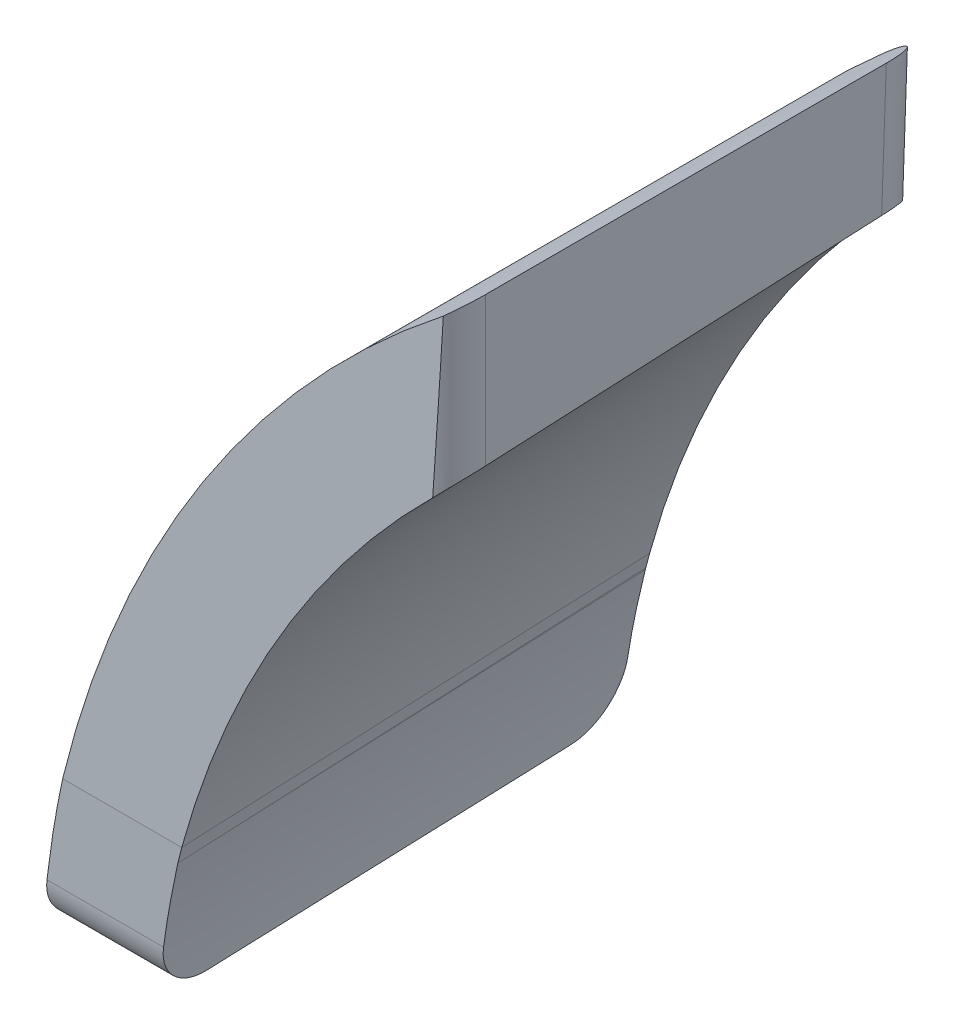
ISO-10303-21;
HEADER;
FILE_DESCRIPTION(('STEP AP214'),'2;1');
FILE_NAME('part.step','',(''),(''),'','','');
FILE_SCHEMA(('AUTOMOTIVE_DESIGN { 1 0 10303 214 1 1 1 1 }'));
ENDSEC;
DATA;
#1=APPLICATION_CONTEXT('core data for automotive mechanical design processes');
#2=APPLICATION_PROTOCOL_DEFINITION('international standard','automotive_design',2000,#1);
#3=PRODUCT_CONTEXT('',#1,'mechanical');
#4=PRODUCT('Part','Part','',(#3));
#5=PRODUCT_RELATED_PRODUCT_CATEGORY('part','',(#4));
#6=PRODUCT_DEFINITION_FORMATION('','',#4);
#7=PRODUCT_DEFINITION_CONTEXT('part definition',#1,'design');
#8=PRODUCT_DEFINITION('design','',#6,#7);
#9=PRODUCT_DEFINITION_SHAPE('','',#8);
#10=(LENGTH_UNIT() NAMED_UNIT(*) SI_UNIT(.MILLI.,.METRE.));
#11=(NAMED_UNIT(*) PLANE_ANGLE_UNIT() SI_UNIT($,.RADIAN.));
#12=(NAMED_UNIT(*) SI_UNIT($,.STERADIAN.) SOLID_ANGLE_UNIT());
#13=UNCERTAINTY_MEASURE_WITH_UNIT(LENGTH_MEASURE(1.E-05),#10,'distance_accuracy_value','');
#14=(GEOMETRIC_REPRESENTATION_CONTEXT(3) GLOBAL_UNCERTAINTY_ASSIGNED_CONTEXT((#13)) GLOBAL_UNIT_ASSIGNED_CONTEXT((#10,
#11,#12)) REPRESENTATION_CONTEXT('',''));
#15=CARTESIAN_POINT('',(0.,0.,0.));
#16=DIRECTION('',(0.,0.,1.));
#17=DIRECTION('',(1.,0.,0.));
#18=AXIS2_PLACEMENT_3D('',#15,#16,#17);
#19=CARTESIAN_POINT('',(-0.10127246753997,1.5,2.));
#20=DIRECTION('',(1.,0.,0.));
#21=DIRECTION('',(0.,0.,1.));
#22=AXIS2_PLACEMENT_3D('',#19,#20,#21);
#23=CYLINDRICAL_SURFACE('',#22,0.5);
#24=DIRECTION('',(-1.,0.,0.));
#25=VECTOR('',#24,1.);
#26=CARTESIAN_POINT('',(-0.10127246753997,1.,2.));
#27=LINE('',#26,#25);
#28=CARTESIAN_POINT('',(-9.38434590084824,1.,2.));
#29=VERTEX_POINT('',#28);
#30=CARTESIAN_POINT('',(-10.3526138431845,1.,2.));
#31=VERTEX_POINT('',#30);
#32=EDGE_CURVE('E142',#29,#31,#27,.T.);
#33=ORIENTED_EDGE('',*,*,#32,.T.);
#34=CARTESIAN_POINT('',(-10.3526138431845,1.,2.));
#35=CARTESIAN_POINT('',(-10.3526129499968,0.999975608279934,1.97198227180452));
#36=CARTESIAN_POINT('',(-10.3523842095059,1.00235350446522,1.94397209767279));
#37=CARTESIAN_POINT('',(-10.3514644289788,1.01173349210152,1.88876893584366));
#38=CARTESIAN_POINT('',(-10.3507737937514,1.01873153434342,1.86157525435133));
#39=CARTESIAN_POINT('',(-10.3489232195765,1.03717621557399,1.8087433462739));
#40=CARTESIAN_POINT('',(-10.3477630667695,1.04862488167309,1.78310583463273));
#41=CARTESIAN_POINT('',(-10.3449638139676,1.07562648040276,1.73412680593719));
#42=CARTESIAN_POINT('',(-10.3433247880487,1.09117877821559,1.71078493452118));
#43=CARTESIAN_POINT('',(-10.3395592975666,1.12596088273112,1.66701759573912));
#44=CARTESIAN_POINT('',(-10.3374321762692,1.14519563836545,1.64659611841736));
#45=CARTESIAN_POINT('',(-10.3326949167815,1.18677361667692,1.6092702082525));
#46=CARTESIAN_POINT('',(-10.3300846915961,1.20911739903261,1.59236641002279));
#47=CARTESIAN_POINT('',(-10.3243881912718,1.25637306430513,1.56247113555211));
#48=CARTESIAN_POINT('',(-10.3212997778566,1.28129630691665,1.54949804678478));
#49=CARTESIAN_POINT('',(-10.3146964692529,1.33290863576065,1.52791744521672));
#50=CARTESIAN_POINT('',(-10.3111817558962,1.35959696692761,1.51930807919403));
#51=CARTESIAN_POINT('',(-10.304964337901,1.40535557787735,1.50866822222638));
#52=CARTESIAN_POINT('',(-10.3023565222196,1.42416476860025,1.50541808656274));
#53=CARTESIAN_POINT('',(-10.2970055783103,1.46198309803636,1.50108420788972));
#54=CARTESIAN_POINT('',(-10.2942626580344,1.48099189609032,1.49999723593008));
#55=CARTESIAN_POINT('',(-10.2914638298254,1.50000000000133,1.5));
#56=B_SPLINE_CURVE_WITH_KNOTS('',3,(#34,#35,#36,#37,#38,#39,#40,#41,#42,#43,#44,#45,#46,#47,#48,
#49,#50,#51,#52,#53,#54,#55),.UNSPECIFIED.,.F.,.F.,(4,2,2,2,2,2,2,2,2,2,4),(0.,
0.0839406182501633,0.167807766375455,0.251713158023279,0.335605577397045,0.419611543188889,
0.503632651118584,0.588040939969054,0.672413351508142,0.73009306778627,0.787686620890018),.UNSPECIFIED.);
#57=CARTESIAN_POINT('',(-10.2914638298513,1.49999999982513,1.5));
#58=VERTEX_POINT('',#57);
#59=EDGE_CURVE('E135',#31,#58,#56,.T.);
#60=ORIENTED_EDGE('',*,*,#59,.T.);
#61=DIRECTION('',(1.,-1.62395537629E-09,0.));
#62=VECTOR('',#61,1.);
#63=CARTESIAN_POINT('',(-9.82646688726997,1.49999999907,1.5));
#64=LINE('',#63,#62);
#65=CARTESIAN_POINT('',(-9.33474938176077,1.50000000000132,1.5));
#66=VERTEX_POINT('',#65);
#67=EDGE_CURVE('E139',#58,#66,#64,.T.);
#68=ORIENTED_EDGE('',*,*,#67,.T.);
#69=CARTESIAN_POINT('',(-9.38434590084824,1.,2.));
#70=CARTESIAN_POINT('',(-9.38532570922651,0.999975509679983,1.97207405433316));
#71=CARTESIAN_POINT('',(-9.38605679583867,1.00233816426967,1.94414526561396));
#72=CARTESIAN_POINT('',(-9.3869858098614,1.01166697956543,1.88907897468974));
#73=CARTESIAN_POINT('',(-9.3871841371224,1.01862968291633,1.8619408941773));
#74=CARTESIAN_POINT('',(-9.3870134473969,1.03699326952491,1.80919440088129));
#75=CARTESIAN_POINT('',(-9.38664412195896,1.04839656319873,1.78358682760184));
#76=CARTESIAN_POINT('',(-9.38530106497489,1.07530253968393,1.73464897912187));
#77=CARTESIAN_POINT('',(-9.38432745257583,1.09080441403364,1.71131825604464));
#78=CARTESIAN_POINT('',(-9.38174753359139,1.12544259462695,1.66760908394929));
#79=CARTESIAN_POINT('',(-9.38014183616578,1.14457539247061,1.64722781823565));
#80=CARTESIAN_POINT('',(-9.37628197408023,1.18592797165769,1.60995709403816));
#81=CARTESIAN_POINT('',(-9.37402779364227,1.20814782810444,1.59306772053146));
#82=CARTESIAN_POINT('',(-9.36886960016253,1.25509450040792,1.56319582171056));
#83=CARTESIAN_POINT('',(-9.36596372776343,1.27982837642318,1.55022472930718));
#84=CARTESIAN_POINT('',(-9.35953851047382,1.33103709861525,1.5285943319381));
#85=CARTESIAN_POINT('',(-9.35601937265176,1.35751135528121,1.51993357538564));
#86=CARTESIAN_POINT('',(-9.34956102296081,1.40342622774852,1.50902768807008));
#87=CARTESIAN_POINT('',(-9.34675942575335,1.42262382895172,1.50564155189572));
#88=CARTESIAN_POINT('',(-9.34092247875129,1.46121781023742,1.50112774278194));
#89=CARTESIAN_POINT('',(-9.33788748720191,1.48061384756674,1.4999966775794));
#90=CARTESIAN_POINT('',(-9.33474938176077,1.50000000000133,1.5));
#91=B_SPLINE_CURVE_WITH_KNOTS('',3,(#69,#70,#71,#72,#73,#74,#75,#76,#77,#78,#79,#80,#81,#82,#83,
#84,#85,#86,#87,#88,#89,#90),.UNSPECIFIED.,.F.,.F.,(4,2,2,2,2,2,2,2,2,2,4),(0.,
0.0837201085768994,0.167377365348832,0.251080095921102,0.334766328092121,0.418372105943264,
0.501979918148702,0.585829379017167,0.669650582860887,0.728608379806995,0.787477420470714),.UNSPECIFIED.);
#92=EDGE_CURVE('E291',#29,#66,#91,.T.);
#93=ORIENTED_EDGE('',*,*,#92,.F.);
#94=EDGE_LOOP('',(#33,#60,#68,#93));
#95=FACE_BOUND('',#94,.T.);
#96=ADVANCED_FACE('F49',(#95),#23,.T.);
#97=CARTESIAN_POINT('',(-7.10096788104997,1.01744974835,2.));
#98=DIRECTION('',(0.0348994967025033,0.999390827019096,0.));
#99=DIRECTION('',(0.999390827019096,-0.0348994967025033,0.));
#100=AXIS2_PLACEMENT_3D('',#97,#98,#99);
#101=CYLINDRICAL_SURFACE('',#100,0.5);
#102=DIRECTION('',(0.03489949686881,0.999390827013288,0.));
#103=VECTOR('',#102,1.);
#104=CARTESIAN_POINT('',(-6.88850948867997,7.10146208853,1.5));
#105=LINE('',#104,#103);
#106=CARTESIAN_POINT('',(-6.91255897651646,6.41277486680576,1.5));
#107=VERTEX_POINT('',#106);
#108=CARTESIAN_POINT('',(-6.86524040910255,7.76780134178997,1.5));
#109=VERTEX_POINT('',#108);
#110=EDGE_CURVE('E164',#107,#109,#105,.T.);
#111=ORIENTED_EDGE('',*,*,#110,.T.);
#112=CARTESIAN_POINT('',(-6.86524040935667,7.76780134156869,1.5));
#113=CARTESIAN_POINT('',(-6.83355931530696,7.79539986986837,1.50002210660041));
#114=CARTESIAN_POINT('',(-6.80163414605223,7.82284723868128,1.5028330822727));
#115=CARTESIAN_POINT('',(-6.73785054495648,7.87702656022441,1.51445595446335));
#116=CARTESIAN_POINT('',(-6.70599457128704,7.9037512723461,1.52331443746681));
#117=CARTESIAN_POINT('',(-6.64682817149106,7.95279974820115,1.54615300714934));
#118=CARTESIAN_POINT('',(-6.61940037183814,7.97528593025986,1.55947073918397));
#119=CARTESIAN_POINT('',(-6.56635031237351,8.0183493202108,1.59154191719154));
#120=CARTESIAN_POINT('',(-6.54072318153055,8.03893172992001,1.61027993680259));
#121=CARTESIAN_POINT('',(-6.49775602987373,8.07313939478497,1.6486469390088));
#122=CARTESIAN_POINT('',(-6.47983929559043,8.08729474246429,1.66715459130067));
#123=CARTESIAN_POINT('',(-6.44649221641731,8.11348471863716,1.70762109641471));
#124=CARTESIAN_POINT('',(-6.43105979839128,8.12552111616601,1.7295770411231));
#125=CARTESIAN_POINT('',(-6.40589933924355,8.14505311674669,1.77266319935095));
#126=CARTESIAN_POINT('',(-6.3956471784414,8.15297317035518,1.79329368027229));
#127=CARTESIAN_POINT('',(-6.37797973968106,8.16658251626105,1.83640437142863));
#128=CARTESIAN_POINT('',(-6.37055945220272,8.17227574820406,1.85888122903217));
#129=CARTESIAN_POINT('',(-6.36003815351626,8.18033557215462,1.9010322766524));
#130=CARTESIAN_POINT('',(-6.35640419059473,8.18311332119276,1.92049557705234));
#131=CARTESIAN_POINT('',(-6.35150547327359,8.18685469788341,1.95996353985413));
#132=CARTESIAN_POINT('',(-6.3502499536713,8.18781125445195,1.9799700077065));
#133=CARTESIAN_POINT('',(-6.35026901757261,8.18779836816226,2.00000000000012));
#134=B_SPLINE_CURVE_WITH_KNOTS('',3,(#112,#113,#114,#115,#116,#117,#118,#119,#120,#121,#122,
#123,#124,#125,#126,#127,#128,#129,#130,#131,#132,#133),.UNSPECIFIED.,.F.,.F.,(4,2,2,2,2,2,2,2,
2,2,4),(0.,0.126093565037996,0.253169608356326,0.366415048037137,0.479341305304981,
0.567197296387475,0.654979588186308,0.72776531626551,0.800421684537745,0.860178718104615,
0.920167298911572),.UNSPECIFIED.);
#135=CARTESIAN_POINT('',(-6.35026901757346,8.18779836816262,2.));
#136=VERTEX_POINT('',#135);
#137=EDGE_CURVE('E152',#109,#136,#134,.T.);
#138=ORIENTED_EDGE('',*,*,#137,.T.);
#139=DIRECTION('',(-0.0348994967025033,-0.999390827019096,0.));
#140=VECTOR('',#139,1.);
#141=CARTESIAN_POINT('',(-6.37235653600997,7.55529459586,2.));
#142=LINE('',#141,#140);
#143=CARTESIAN_POINT('',(-6.3953267579391,6.89751350266002,2.00000000000012));
#144=VERTEX_POINT('',#143);
#145=EDGE_CURVE('E54',#136,#144,#142,.T.);
#146=ORIENTED_EDGE('',*,*,#145,.T.);
#147=CARTESIAN_POINT('',(-6.92385989719551,6.40074461378488,1.50011826192768));
#148=CARTESIAN_POINT('',(-6.90376092104102,6.42219094466016,1.49970476694414));
#149=CARTESIAN_POINT('',(-6.88351177886103,6.44353448769911,1.50039713014202));
#150=CARTESIAN_POINT('',(-6.84280745559294,6.48591945548131,1.50413631655415));
#151=CARTESIAN_POINT('',(-6.82235187571151,6.50695995053153,1.50718925613275));
#152=CARTESIAN_POINT('',(-6.78118787481859,6.5487802600666,1.51584792481502));
#153=CARTESIAN_POINT('',(-6.76047938443344,6.5695538553639,1.52148404547542));
#154=CARTESIAN_POINT('',(-6.71929498680125,6.61034641190091,1.53550671692901));
#155=CARTESIAN_POINT('',(-6.6988188293532,6.63036625234015,1.54388994515531));
#156=CARTESIAN_POINT('',(-6.65458037932288,6.67306017463445,1.56548341113036));
#157=CARTESIAN_POINT('',(-6.63091551378606,6.69553505675079,1.57930154703416));
#158=CARTESIAN_POINT('',(-6.5850144464817,6.73843028940704,1.61153489785195));
#159=CARTESIAN_POINT('',(-6.56277324945121,6.75885798401953,1.62993278994866));
#160=CARTESIAN_POINT('',(-6.52519570994582,6.79276887113519,1.66721131604768));
#161=CARTESIAN_POINT('',(-6.5094052342593,6.80679925876979,1.68513046032029));
#162=CARTESIAN_POINT('',(-6.47994298525797,6.83255270926025,1.72412590062754));
#163=CARTESIAN_POINT('',(-6.46626924745119,6.84427791426163,1.74519923316858));
#164=CARTESIAN_POINT('',(-6.44425924646983,6.86273860000031,1.78590888999709));
#165=CARTESIAN_POINT('',(-6.43540211924859,6.87000131795268,1.80502261200916));
#166=CARTESIAN_POINT('',(-6.42007763576422,6.88220996402258,1.84486445351273));
#167=CARTESIAN_POINT('',(-6.41360615764195,6.88715989211167,1.86558971287178));
#168=CARTESIAN_POINT('',(-6.40391409826051,6.89410583033422,1.90626770554647));
#169=CARTESIAN_POINT('',(-6.40045555276308,6.89632542709243,1.92612517473211));
#170=CARTESIAN_POINT('',(-6.39600709112188,6.89848338254314,1.96634607563305));
#171=CARTESIAN_POINT('',(-6.3950310805224,6.89840892174951,1.98671171492532));
#172=CARTESIAN_POINT('',(-6.39538940145649,6.89712523722026,2.00700376194722));
#173=B_SPLINE_CURVE_WITH_KNOTS('',3,(#147,#148,#149,#150,#151,#152,#153,#154,#155,#156,#157,
#158,#159,#160,#161,#162,#163,#164,#165,#166,#167,#168,#169,#170,#171,#172),.UNSPECIFIED.,.F.,
.F.,(4,2,2,2,2,2,2,2,2,2,2,2,4),(0.,0.0881824524501346,0.176594158597143,0.266073855463907,
0.35544572557985,0.461446024873163,0.567051316021728,0.649860331259337,0.732592026703035,
0.799172688949339,0.865637769722107,0.926190782810254,0.987082234912873),.UNSPECIFIED.);
#174=EDGE_CURVE('E350',#107,#144,#173,.T.);
#175=ORIENTED_EDGE('',*,*,#174,.F.);
#176=EDGE_LOOP('',(#111,#138,#146,#175));
#177=FACE_BOUND('',#176,.T.);
#178=ADVANCED_FACE('F369',(#177),#101,.T.);
#179=CARTESIAN_POINT('',(-0.10127246753997,0.,1.5));
#180=DIRECTION('',(0.,0.,1.));
#181=DIRECTION('',(1.,0.,0.));
#182=AXIS2_PLACEMENT_3D('',#179,#180,#181);
#183=PLANE('',#182);
#184=CARTESIAN_POINT('',(-0.101272467539999,0.,1.5));
#185=DIRECTION('',(0.,0.,1.));
#186=DIRECTION('',(1.,0.,0.));
#187=AXIS2_PLACEMENT_3D('',#184,#185,#186);
#188=CIRCLE('',#187,10.3);
#189=EDGE_CURVE('E149',#58,#109,#188,.F.);
#190=ORIENTED_EDGE('',*,*,#189,.T.);
#191=ORIENTED_EDGE('',*,*,#110,.F.);
#192=CARTESIAN_POINT('',(-0.101272467270898,-0.000112890154721015,1.5));
#193=DIRECTION('',(0.,0.,1.));
#194=DIRECTION('',(1.,0.,0.));
#195=AXIS2_PLACEMENT_3D('',#192,#193,#194);
#196=CIRCLE('',#195,9.35514581898135);
#197=CARTESIAN_POINT('',(-9.12312443966021,2.47474877925213,1.5));
#198=VERTEX_POINT('',#197);
#199=EDGE_CURVE('E246',#107,#198,#196,.T.);
#200=ORIENTED_EDGE('',*,*,#199,.T.);
#201=CARTESIAN_POINT('',(-9.12286985314753,2.47567893513201,1.5));
#202=CARTESIAN_POINT('',(-9.12616137070916,2.46365942381515,1.5));
#203=CARTESIAN_POINT('',(-9.12942896838536,2.45163336759737,1.5));
#204=CARTESIAN_POINT('',(-9.13591623158933,2.42756833122311,1.5));
#205=CARTESIAN_POINT('',(-9.1391358971067,2.41552935106382,1.5));
#206=CARTESIAN_POINT('',(-9.1483442385153,2.3808203974254,1.5));
#207=CARTESIAN_POINT('',(-9.15427191849076,2.35813422702612,1.5));
#208=CARTESIAN_POINT('',(-9.1601142795758,2.3354260443574,1.5));
#209=B_SPLINE_CURVE_WITH_KNOTS('',3,(#201,#202,#203,#204,#205,#206,#207,#208),.UNSPECIFIED.,.F.,
.F.,(4,2,2,4),(0.,0.0373861206054076,0.074772249317905,0.14511505319772),.UNSPECIFIED.);
#210=CARTESIAN_POINT('',(-9.1601142795759,2.33542604435699,1.5));
#211=VERTEX_POINT('',#210);
#212=EDGE_CURVE('E237',#198,#211,#209,.T.);
#213=ORIENTED_EDGE('',*,*,#212,.T.);
#214=CARTESIAN_POINT('',(-9.16008563045518,2.33550862748655,1.5));
#215=CARTESIAN_POINT('',(-9.16048819948504,2.33394739584219,1.5));
#216=CARTESIAN_POINT('',(-9.1608903653646,2.3323860602568,1.5));
#217=CARTESIAN_POINT('',(-9.16169389066817,2.32926318158278,1.5));
#218=CARTESIAN_POINT('',(-9.16209525009219,2.32770163849416,1.5));
#219=CARTESIAN_POINT('',(-9.16325488442445,2.3231850867162,1.5));
#220=CARTESIAN_POINT('',(-9.16401211867714,2.32022981080352,1.5));
#221=CARTESIAN_POINT('',(-9.16476790844424,2.31727416538854,1.5));
#222=B_SPLINE_CURVE_WITH_KNOTS('',3,(#214,#215,#216,#217,#218,#219,#220,#221),.UNSPECIFIED.,.F.,
.F.,(4,2,2,4),(0.,0.0048368950663167,0.00967379013265398,0.0188260308289573),.UNSPECIFIED.);
#223=CARTESIAN_POINT('',(-9.16476790844409,2.31727416538912,1.5));
#224=VERTEX_POINT('',#223);
#225=EDGE_CURVE('E229',#211,#224,#222,.T.);
#226=ORIENTED_EDGE('',*,*,#225,.T.);
#227=CARTESIAN_POINT('',(-9.16126901962722,2.33097667151527,1.5));
#228=CARTESIAN_POINT('',(-9.19647456924794,2.19379415269682,1.5));
#229=CARTESIAN_POINT('',(-9.22853404092787,2.05595483717288,1.5));
#230=CARTESIAN_POINT('',(-9.28636082840619,1.77896261271402,1.5));
#231=CARTESIAN_POINT('',(-9.31212814420457,1.6398097037791,1.5));
#232=CARTESIAN_POINT('',(-9.33474938206217,1.49999999813868,1.5));
#233=B_SPLINE_CURVE_WITH_KNOTS('',3,(#227,#228,#229,#230,#231,#232),.UNSPECIFIED.,.F.,.F.,(4,2,
4),(0.,0.424555508333767,0.849111016667533),.UNSPECIFIED.);
#234=EDGE_CURVE('E162',#224,#66,#233,.T.);
#235=ORIENTED_EDGE('',*,*,#234,.T.);
#236=ORIENTED_EDGE('',*,*,#67,.F.);
#237=EDGE_LOOP('',(#190,#191,#200,#213,#226,#235,#236));
#238=FACE_BOUND('',#237,.T.);
#239=ADVANCED_FACE('F160',(#238),#183,.F.);
#240=CARTESIAN_POINT('',(-7.09245279908997,1.26128979197,5.60881966845));
#241=DIRECTION('',(0.034878262742377,0.998782765958718,0.0348782627423901));
#242=DIRECTION('',(-0.999390827019096,0.0348994967025033,0.));
#243=AXIS2_PLACEMENT_3D('',#240,#241,#242);
#244=CYLINDRICAL_SURFACE('',#243,0.5);
#245=DIRECTION('',(0.0348782627423901,0.998782765958717,0.0348782627423901));
#246=VECTOR('',#245,1.);
#247=CARTESIAN_POINT('',(-6.59275738558997,1.24384004436,5.60881966847));
#248=LINE('',#247,#246);
#249=CARTESIAN_POINT('',(-6.40185134195776,6.71067386203611,5.79972571206741));
#250=VERTEX_POINT('',#249);
#251=CARTESIAN_POINT('',(-6.3502690175881,8.18779836816313,5.85130803645596));
#252=VERTEX_POINT('',#251);
#253=EDGE_CURVE('E180',#250,#252,#248,.T.);
#254=ORIENTED_EDGE('',*,*,#253,.T.);
#255=CARTESIAN_POINT('',(-6.35026901756861,8.18779836816531,5.85130803645606));
#256=CARTESIAN_POINT('',(-6.35023060620214,8.1878247579961,5.87444539292898));
#257=CARTESIAN_POINT('',(-6.35191530192619,8.18654193460197,5.89755363754496));
#258=CARTESIAN_POINT('',(-6.35846456689589,8.18153874490015,5.94291416546409));
#259=CARTESIAN_POINT('',(-6.3633110983807,8.17783220522506,5.96517055056554));
#260=CARTESIAN_POINT('',(-6.37591680215057,8.16816364183392,6.00828537464794));
#261=CARTESIAN_POINT('',(-6.38367313327798,8.16220381820285,6.02914515395101));
#262=CARTESIAN_POINT('',(-6.40168322850332,8.14830986605029,6.069064685095));
#263=CARTESIAN_POINT('',(-6.41193901741333,8.14037413673312,6.08812296007592));
#264=CARTESIAN_POINT('',(-6.42803104083031,8.12786339881886,6.1138367736296));
#265=CARTESIAN_POINT('',(-6.43304548559663,8.12395800186762,6.1213585086208));
#266=CARTESIAN_POINT('',(-6.44339688999368,8.11587954877995,6.13598523602896));
#267=CARTESIAN_POINT('',(-6.4487328014986,8.11170736003418,6.1430914482115));
#268=CARTESIAN_POINT('',(-6.45422126669784,8.10740658628141,6.15000000000003));
#269=B_SPLINE_CURVE_WITH_KNOTS('',3,(#255,#256,#257,#258,#259,#260,#261,#262,#263,#264,#265,
#266,#267,#268),.UNSPECIFIED.,.F.,.F.,(4,2,2,2,2,2,4),(0.,0.0692685222697828,0.138145294209908,
0.206954988477814,0.27582061189494,0.305349353976854,0.334786545191084),.UNSPECIFIED.);
#270=CARTESIAN_POINT('',(-6.45422126669787,8.10740658628137,6.15));
#271=VERTEX_POINT('',#270);
#272=EDGE_CURVE('E384',#252,#271,#269,.T.);
#273=ORIENTED_EDGE('',*,*,#272,.T.);
#274=CARTESIAN_POINT('',(-6.55127246754017,16.7586668379611,6.15));
#275=DIRECTION('',(0.,0.,1.));
#276=DIRECTION('',(0.0348994967025034,0.999390827019096,0.));
#277=AXIS2_PLACEMENT_3D('',#274,#275,#276);
#278=ELLIPSE('',#277,14.3355763930384,0.5);
#279=CARTESIAN_POINT('',(-6.55662826999361,6.54476096262435,6.15000000001552));
#280=VERTEX_POINT('',#279);
#281=EDGE_CURVE('E189',#280,#271,#278,.T.);
#282=ORIENTED_EDGE('',*,*,#281,.F.);
#283=CARTESIAN_POINT('',(-6.40190749288779,6.71101595285766,5.79148325666342));
#284=CARTESIAN_POINT('',(-6.40152642538114,6.71030412414137,5.81374301957823));
#285=CARTESIAN_POINT('',(-6.40276175606367,6.70808531099325,5.83592510065077));
#286=CARTESIAN_POINT('',(-6.40813074279627,6.70096402283767,5.87920734580058));
#287=CARTESIAN_POINT('',(-6.41222733692628,6.69609603865753,5.90031768201466));
#288=CARTESIAN_POINT('',(-6.42297758106987,6.68398812615692,5.94108053776002));
#289=CARTESIAN_POINT('',(-6.42962517260629,6.67675382367517,5.96073638069439));
#290=CARTESIAN_POINT('',(-6.44508253262596,6.66025276923838,5.99841294167681));
#291=CARTESIAN_POINT('',(-6.45390597781042,6.65097320221015,6.01642228887296));
#292=CARTESIAN_POINT('',(-6.47714763723008,6.62672609386404,6.05735969556817));
#293=CARTESIAN_POINT('',(-6.4923877444258,6.6109731385264,6.07934643231056));
#294=CARTESIAN_POINT('',(-6.52502275197265,6.57732128483436,6.1192770545796));
#295=CARTESIAN_POINT('',(-6.5423930449008,6.55944695775958,6.13726140216753));
#296=CARTESIAN_POINT('',(-6.56041280322956,6.54085467148054,6.15337033582095));
#297=B_SPLINE_CURVE_WITH_KNOTS('',3,(#283,#284,#285,#286,#287,#288,#289,#290,#291,#292,#293,
#294,#295,#296),.UNSPECIFIED.,.F.,.F.,(4,2,2,2,2,2,4),(0.,0.0666360309856447,0.13242455749124,
0.198057797312079,0.264114599631755,0.356783230918794,0.448467546612639),.UNSPECIFIED.);
#298=EDGE_CURVE('E223',#250,#280,#297,.T.);
#299=ORIENTED_EDGE('',*,*,#298,.F.);
#300=EDGE_LOOP('',(#254,#273,#282,#299));
#301=FACE_BOUND('',#300,.T.);
#302=ADVANCED_FACE('F365',(#301),#244,.T.);
#303=CARTESIAN_POINT('',(-6.60127246753997,1.,0.));
#304=DIRECTION('',(-0.999390827019096,0.0348994967025033,0.));
#305=DIRECTION('',(0.,0.,1.));
#306=AXIS2_PLACEMENT_3D('',#303,#304,#305);
#307=PLANE('',#306);
#308=DIRECTION('',(0.,0.,1.));
#309=VECTOR('',#308,1.);
#310=CARTESIAN_POINT('',(-6.3502690175722,8.18779836816258,-23.2551069659978));
#311=LINE('',#310,#309);
#312=EDGE_CURVE('E145',#252,#136,#311,.F.);
#313=ORIENTED_EDGE('',*,*,#312,.F.);
#314=ORIENTED_EDGE('',*,*,#253,.F.);
#315=CARTESIAN_POINT('',(-6.4019578012958,6.70762526556739,5.86127698540398));
#316=CARTESIAN_POINT('',(-6.40084271415127,6.73955718347083,5.21657925726298));
#317=CARTESIAN_POINT('',(-6.39973159229721,6.77137555031161,4.57187593821784));
#318=CARTESIAN_POINT('',(-6.39751727917058,6.83478518185353,3.28245811861104));
#319=CARTESIAN_POINT('',(-6.396414087898,6.86637644655476,2.63774361804938));
#320=CARTESIAN_POINT('',(-6.39531486191589,6.89785416019345,1.99302352658358));
#321=B_SPLINE_CURVE_WITH_KNOTS('',3,(#315,#316,#317,#318,#319,#320),.UNSPECIFIED.,.F.,.F.,(4,2,
4),(0.,1.93646691524335,3.8729338296103),.UNSPECIFIED.);
#322=EDGE_CURVE('E185',#250,#144,#321,.T.);
#323=ORIENTED_EDGE('',*,*,#322,.T.);
#324=ORIENTED_EDGE('',*,*,#145,.F.);
#325=EDGE_LOOP('',(#313,#314,#323,#324));
#326=FACE_BOUND('',#325,.T.);
#327=ADVANCED_FACE('F362',(#326),#307,.F.);
#328=CARTESIAN_POINT('',(-0.10127246753997,1.,0.));
#329=DIRECTION('',(0.,1.,0.));
#330=DIRECTION('',(1.,0.,0.));
#331=AXIS2_PLACEMENT_3D('',#328,#329,#330);
#332=PLANE('',#331);
#333=DIRECTION('',(0.,0.,1.));
#334=VECTOR('',#333,1.);
#335=CARTESIAN_POINT('',(-10.3526138431845,1.,-23.2551069659978));
#336=LINE('',#335,#334);
#337=CARTESIAN_POINT('',(-10.3526138431845,1.,5.6171556126));
#338=VERTEX_POINT('',#337);
#339=EDGE_CURVE('E146',#31,#338,#336,.T.);
#340=ORIENTED_EDGE('',*,*,#339,.F.);
#341=ORIENTED_EDGE('',*,*,#32,.F.);
#342=CARTESIAN_POINT('',(-9.38434590084824,1.,2.));
#343=CARTESIAN_POINT('',(-9.34199696525389,0.999999999999996,3.20571853779334));
#344=CARTESIAN_POINT('',(-9.29964802965955,0.999999999999991,4.41143707558667));
#345=CARTESIAN_POINT('',(-9.2572990940652,0.999999999999987,5.61715561338));
#346=B_SPLINE_CURVE_WITH_KNOTS('',3,(#342,#343,#344,#345),.UNSPECIFIED.,.F.,.F.,(4,4),(0.,
3.61938608365013),.UNSPECIFIED.);
#347=CARTESIAN_POINT('',(-9.25729909409259,1.,5.6171556126));
#348=VERTEX_POINT('',#347);
#349=EDGE_CURVE('E327',#29,#348,#346,.T.);
#350=ORIENTED_EDGE('',*,*,#349,.T.);
#351=DIRECTION('',(1.,0.,0.));
#352=VECTOR('',#351,1.);
#353=CARTESIAN_POINT('',(-9.81849604659997,1.,5.61715561338));
#354=LINE('',#353,#352);
#355=EDGE_CURVE('E194',#338,#348,#354,.T.);
#356=ORIENTED_EDGE('',*,*,#355,.F.);
#357=EDGE_LOOP('',(#340,#341,#350,#356));
#358=FACE_BOUND('',#357,.T.);
#359=ADVANCED_FACE('F305',(#358),#332,.F.);
#360=CARTESIAN_POINT('',(-0.101272467539968,1.,6.1));
#361=DIRECTION('',(0.,0.0348994967025033,-0.999390827019096));
#362=DIRECTION('',(-1.,0.,0.));
#363=AXIS2_PLACEMENT_3D('',#360,#361,#362);
#364=PLANE('',#363);
#365=CARTESIAN_POINT('',(-0.101272467539999,0.,6.06507923050825));
#366=DIRECTION('',(0.,0.0348994967025033,-0.999390827019096));
#367=DIRECTION('',(0.,0.999390827019096,0.0348994967025033));
#368=AXIS2_PLACEMENT_3D('',#365,#366,#367);
#369=ELLIPSE('',#368,10.3062783062779,10.3);
#370=CARTESIAN_POINT('',(-10.2940171789184,1.48255025165001,6.11685102610959));
#371=VERTEX_POINT('',#370);
#372=CARTESIAN_POINT('',(-10.1100829444783,2.43181266481,6.15));
#373=VERTEX_POINT('',#372);
#374=EDGE_CURVE('E70',#371,#373,#369,.T.);
#375=ORIENTED_EDGE('',*,*,#374,.F.);
#376=DIRECTION('',(-1.,0.,0.));
#377=VECTOR('',#376,1.);
#378=CARTESIAN_POINT('',(-0.10127246753997,1.48255025165,6.11685102611));
#379=LINE('',#378,#377);
#380=CARTESIAN_POINT('',(-9.17421100450544,1.48255025200507,6.11685102611803));
#381=VERTEX_POINT('',#380);
#382=EDGE_CURVE('E203',#381,#371,#379,.T.);
#383=ORIENTED_EDGE('',*,*,#382,.F.);
#384=CARTESIAN_POINT('',(-9.00762839172688,2.27709192927701,6.14459703288206));
#385=CARTESIAN_POINT('',(-9.01551828349224,2.24631981566633,6.14352244441624));
#386=CARTESIAN_POINT('',(-9.02324775721418,2.21550662448075,6.14244639413548));
#387=CARTESIAN_POINT('',(-9.03852630122561,2.15322735054017,6.14027147031941));
#388=CARTESIAN_POINT('',(-9.04606933718852,2.1217597891271,6.13917254471606));
#389=CARTESIAN_POINT('',(-9.06095642048588,2.05817087541204,6.13695187135981));
#390=CARTESIAN_POINT('',(-9.06829431275991,2.02604808380366,6.13583007352285));
#391=CARTESIAN_POINT('',(-9.08275213964358,1.96114812356456,6.13356365297294));
#392=CARTESIAN_POINT('',(-9.08986579812192,1.92836955839609,6.13241898198155));
#393=CARTESIAN_POINT('',(-9.10385580037065,1.86215780019917,6.13010681362895));
#394=CARTESIAN_POINT('',(-9.11072574656473,1.82872325695824,6.12893926971797));
#395=CARTESIAN_POINT('',(-9.12420857723844,1.7611996442646,6.12658135363059));
#396=CARTESIAN_POINT('',(-9.13081494232477,1.72710927452626,6.12539093653278));
#397=CARTESIAN_POINT('',(-9.1437504710795,1.65827448280416,6.12298727310006));
#398=CARTESIAN_POINT('',(-9.15007299315131,1.62352881415251,6.12177398340105));
#399=CARTESIAN_POINT('',(-9.16242030135182,1.55338428706647,6.11932457096117));
#400=CARTESIAN_POINT('',(-9.1684383232876,1.51798423929727,6.11808840628421));
#401=CARTESIAN_POINT('',(-9.17424912328092,1.48255025165014,6.11685102610606));
#402=B_SPLINE_CURVE_WITH_KNOTS('',3,(#384,#385,#386,#387,#388,#389,#390,#391,#392,#393,#394,
#395,#396,#397,#398,#399,#400,#401),.UNSPECIFIED.,.F.,.F.,(4,2,2,2,2,2,2,2,4),(0.,
0.0953565462321325,0.19248768875875,0.291393770539022,0.392075114574709,0.494532021924451,
0.598764770331081,0.704773613583249,0.812558781742369),.UNSPECIFIED.);
#403=CARTESIAN_POINT('',(-9.00654415354906,2.28075897118437,6.14760347189797));
#404=VERTEX_POINT('',#403);
#405=EDGE_CURVE('E334',#381,#404,#402,.F.);
#406=ORIENTED_EDGE('',*,*,#405,.T.);
#407=CARTESIAN_POINT('',(-8.96652802137026,2.4317914713315,6.14999925993062));
#408=CARTESIAN_POINT('',(-8.96809263793665,2.42610188604948,6.14980024602848));
#409=CARTESIAN_POINT('',(-8.96965179574864,2.42041080001497,6.14960122084778));
#410=CARTESIAN_POINT('',(-8.97275901412236,2.40902627072892,6.14920317048403));
#411=CARTESIAN_POINT('',(-8.97430707588241,2.40333282780435,6.14900414530337));
#412=CARTESIAN_POINT('',(-8.97739210208723,2.39194358470941,6.14860609493965));
#413=CARTESIAN_POINT('',(-8.97892906769096,2.38624778485289,6.14840706975883));
#414=CARTESIAN_POINT('',(-8.9819919015592,2.37485382788304,6.14800901939497));
#415=CARTESIAN_POINT('',(-8.98351777094321,2.36915567107056,6.14780999421403));
#416=CARTESIAN_POINT('',(-8.98655841233618,2.35775700017326,6.14741194385009));
#417=CARTESIAN_POINT('',(-8.9880731854251,2.35205648637645,6.14721291866903));
#418=CARTESIAN_POINT('',(-8.99109163419784,2.34065310149774,6.146814868305));
#419=CARTESIAN_POINT('',(-8.99259531092202,2.33495023069115,6.14661584312383));
#420=CARTESIAN_POINT('',(-8.99559156692312,2.32354213177596,6.14621779275968));
#421=CARTESIAN_POINT('',(-8.99708414720071,2.31783690393013,6.14601876757836));
#422=CARTESIAN_POINT('',(-9.00005821030835,2.30642409093582,6.14562071721421));
#423=CARTESIAN_POINT('',(-9.00153969409929,2.30071650603769,6.14542169203292));
#424=CARTESIAN_POINT('',(-9.00301569103357,2.29500750286061,6.14522265849748));
#425=B_SPLINE_CURVE_WITH_KNOTS('',3,(#407,#408,#409,#410,#411,#412,#413,#414,#415,#416,#417,
#418,#419,#420,#421,#422,#423,#424),.UNSPECIFIED.,.F.,.F.,(4,2,2,2,2,2,2,2,4),(0.,
0.0177124536466021,0.0354229647177055,0.053131598423534,0.0708384199946172,0.0885434946810676,
0.10624688775188,0.123948664494212,0.141648890212669),.UNSPECIFIED.);
#426=CARTESIAN_POINT('',(-8.96652654257581,2.43179676440738,6.1500000070775));
#427=VERTEX_POINT('',#426);
#428=EDGE_CURVE('E283',#404,#427,#425,.F.);
#429=ORIENTED_EDGE('',*,*,#428,.T.);
#430=DIRECTION('',(-1.,0.,0.));
#431=VECTOR('',#430,1.);
#432=CARTESIAN_POINT('',(-9.55181522947997,2.43181266481,6.15000000002));
#433=LINE('',#432,#431);
#434=EDGE_CURVE('E212',#427,#373,#433,.T.);
#435=ORIENTED_EDGE('',*,*,#434,.T.);
#436=EDGE_LOOP('',(#375,#383,#406,#429,#435));
#437=FACE_BOUND('',#436,.T.);
#438=ADVANCED_FACE('F430',(#437),#364,.F.);
#439=CARTESIAN_POINT('',(-0.101272467539968,1.5,5.6171556126));
#440=DIRECTION('',(1.,0.,0.));
#441=DIRECTION('',(0.,0.,1.));
#442=AXIS2_PLACEMENT_3D('',#439,#440,#441);
#443=CYLINDRICAL_SURFACE('',#442,0.5);
#444=ORIENTED_EDGE('',*,*,#382,.T.);
#445=CARTESIAN_POINT('',(-10.2940171789184,1.48255025165001,6.11685102610959));
#446=CARTESIAN_POINT('',(-10.2981182175444,1.45438601669502,6.11589135577466));
#447=CARTESIAN_POINT('',(-10.3020812941786,1.42628951768648,6.11250370368999));
#448=CARTESIAN_POINT('',(-10.3096530253034,1.37102860811087,6.10105216067666));
#449=CARTESIAN_POINT('',(-10.3132618248023,1.34386381917538,6.09299019238905));
#450=CARTESIAN_POINT('',(-10.3200524154621,1.29121978652833,6.07236132617825));
#451=CARTESIAN_POINT('',(-10.3232339010587,1.26574175551857,6.0597912279006));
#452=CARTESIAN_POINT('',(-10.3291220112546,1.21724656539953,6.03049834054651));
#453=CARTESIAN_POINT('',(-10.3318287921096,1.19422859750336,6.01377692233093));
#454=CARTESIAN_POINT('',(-10.3367294781169,1.15146920187482,5.976767509378));
#455=CARTESIAN_POINT('',(-10.3389266376969,1.13170723042142,5.95650368209352));
#456=CARTESIAN_POINT('',(-10.3428263125462,1.09585625290962,5.91289952671578));
#457=CARTESIAN_POINT('',(-10.3445286927461,1.07976825006132,5.88955836106545));
#458=CARTESIAN_POINT('',(-10.3474342270437,1.05183927614204,5.84063040592957));
#459=CARTESIAN_POINT('',(-10.3486404361823,1.03997237790496,5.815058570667));
#460=CARTESIAN_POINT('',(-10.350577872464,1.02070242138943,5.76228059789703));
#461=CARTESIAN_POINT('',(-10.3513095350516,1.01329527128886,5.73507598374971));
#462=CARTESIAN_POINT('',(-10.3520775473765,1.00548601324602,5.69256273595804));
#463=CARTESIAN_POINT('',(-10.3522789284669,1.00342887678508,5.67754278712494));
#464=CARTESIAN_POINT('',(-10.3525468566321,1.00068687805265,5.64740271025865));
#465=CARTESIAN_POINT('',(-10.352613632396,0.999999688318144,5.6322827959978));
#466=CARTESIAN_POINT('',(-10.3526138431848,0.999999999999787,5.61715561260005));
#467=B_SPLINE_CURVE_WITH_KNOTS('',3,(#445,#446,#447,#448,#449,#450,#451,#452,#453,#454,#455,
#456,#457,#458,#459,#460,#461,#462,#463,#464,#465,#466),.UNSPECIFIED.,.F.,.F.,(4,2,2,2,2,2,2,2,
2,2,4),(0.,0.0853265254584277,0.170617979259432,0.255970102331818,0.341294077582308,
0.426057175353974,0.510843390848816,0.595099448250767,0.679278082387406,0.724706747441497,
0.770058165729826),.UNSPECIFIED.);
#468=EDGE_CURVE('E157',#371,#338,#467,.T.);
#469=ORIENTED_EDGE('',*,*,#468,.T.);
#470=ORIENTED_EDGE('',*,*,#355,.T.);
#471=CARTESIAN_POINT('',(-9.17424912328081,1.48255025165001,6.1168510261096));
#472=CARTESIAN_POINT('',(-9.17889773866088,1.45422946690747,6.11588550522945));
#473=CARTESIAN_POINT('',(-9.18347442113962,1.42598643712242,6.11246656264853));
#474=CARTESIAN_POINT('',(-9.19238979447349,1.37045645800088,6.10090774041816));
#475=CARTESIAN_POINT('',(-9.19672858214383,1.34316912138719,6.09276979708904));
#476=CARTESIAN_POINT('',(-9.20508081069097,1.29030881406297,6.07195078893183));
#477=CARTESIAN_POINT('',(-9.20909403083508,1.26473700847075,6.05926667288085));
#478=CARTESIAN_POINT('',(-9.21672998367114,1.21608583005151,6.02971119810268));
#479=CARTESIAN_POINT('',(-9.22035284302138,1.19300564877566,6.01284120344877));
#480=CARTESIAN_POINT('',(-9.2271473241261,1.15014765871733,5.97549419242713));
#481=CARTESIAN_POINT('',(-9.23032153453974,1.13035078009746,5.95503953445008));
#482=CARTESIAN_POINT('',(-9.23621891875415,1.0944852415732,5.91103177714015));
#483=CARTESIAN_POINT('',(-9.23894213335651,1.07841624435462,5.88747895844414));
#484=CARTESIAN_POINT('',(-9.24390114574231,1.05059980302823,5.83814377032854));
#485=CARTESIAN_POINT('',(-9.2461405154922,1.03882021569029,5.81237985043285));
#486=CARTESIAN_POINT('',(-9.25014186446787,1.01977612801454,5.75921339190001));
#487=CARTESIAN_POINT('',(-9.25190432841323,1.0125070334885,5.73181255185602));
#488=CARTESIAN_POINT('',(-9.25419943581736,1.00507128504773,5.68967006304877));
#489=CARTESIAN_POINT('',(-9.25491430413578,1.00316986007822,5.67522426521985));
#490=CARTESIAN_POINT('',(-9.25620841704533,1.00063525508743,5.64624057517604));
#491=CARTESIAN_POINT('',(-9.25678788977837,0.999999927883782,5.63170288089641));
#492=CARTESIAN_POINT('',(-9.25729909409262,0.999999999999465,5.61715561260006));
#493=B_SPLINE_CURVE_WITH_KNOTS('',3,(#471,#472,#473,#474,#475,#476,#477,#478,#479,#480,#481,
#482,#483,#484,#485,#486,#487,#488,#489,#490,#491,#492),.UNSPECIFIED.,.F.,.F.,(4,2,2,2,2,2,2,2,
2,2,4),(0.,0.0860400197433695,0.17204476013891,0.258107332158891,0.34414189528559,
0.429657790982676,0.515165945825733,0.600019465066425,0.684786413785048,0.728501178588705,
0.772141743969966),.UNSPECIFIED.);
#494=EDGE_CURVE('E201',#381,#348,#493,.T.);
#495=ORIENTED_EDGE('',*,*,#494,.F.);
#496=EDGE_LOOP('',(#444,#469,#470,#495));
#497=FACE_BOUND('',#496,.T.);
#498=ADVANCED_FACE('F366',(#497),#443,.T.);
#499=CARTESIAN_POINT('',(-0.101272467539999,0.,6.15));
#500=DIRECTION('',(0.,0.,1.));
#501=DIRECTION('',(1.,0.,0.));
#502=AXIS2_PLACEMENT_3D('',#499,#500,#501);
#503=PLANE('',#502);
#504=ORIENTED_EDGE('',*,*,#281,.T.);
#505=CARTESIAN_POINT('',(-0.101272467539999,0.,6.15));
#506=DIRECTION('',(0.,0.,1.));
#507=DIRECTION('',(1.,0.,0.));
#508=AXIS2_PLACEMENT_3D('',#505,#506,#507);
#509=CIRCLE('',#508,10.3);
#510=EDGE_CURVE('E11',#271,#373,#509,.T.);
#511=ORIENTED_EDGE('',*,*,#510,.T.);
#512=ORIENTED_EDGE('',*,*,#434,.F.);
#513=CARTESIAN_POINT('',(-0.101272467270898,-0.000112890154721015,6.15));
#514=DIRECTION('',(0.,0.,1.));
#515=DIRECTION('',(1.,0.,0.));
#516=AXIS2_PLACEMENT_3D('',#513,#514,#515);
#517=CIRCLE('',#516,9.19276424084472);
#518=EDGE_CURVE('E220',#280,#427,#517,.T.);
#519=ORIENTED_EDGE('',*,*,#518,.F.);
#520=EDGE_LOOP('',(#504,#511,#512,#519));
#521=FACE_BOUND('',#520,.T.);
#522=ADVANCED_FACE('F303',(#521),#503,.T.);
#523=CARTESIAN_POINT('',(-9.71412074609731,-0.00022566861823882,-5.91845220782991));
#524=CARTESIAN_POINT('',(-9.71455039004614,0.802140831917706,-5.91845220782991));
#525=CARTESIAN_POINT('',(-9.61404162122465,1.60425229903761,-5.91845220782991));
#526=CARTESIAN_POINT('',(-9.41580356194052,2.38123319547278,-5.91845220782991));
#527=CARTESIAN_POINT('',(-9.41382118134768,2.38900300443713,-5.91845220782991));
#528=CARTESIAN_POINT('',(-9.41183880075484,2.39677281340148,-5.91845220782991));
#529=CARTESIAN_POINT('',(-9.409856420162,2.40454262236583,-5.91845220782991));
#530=CARTESIAN_POINT('',(-9.29029076541686,1.27999140767131E-06,6.21845220782991));
#531=CARTESIAN_POINT('',(-9.29070146474815,0.766988532504128,6.21845220782991));
#532=CARTESIAN_POINT('',(-9.19462194315696,1.53375077805571,6.21845220782991));
#533=CARTESIAN_POINT('',(-9.00512939237682,2.27645423535947,6.21845220782991));
#534=CARTESIAN_POINT('',(-9.00323446686902,2.28388126993251,6.21845220782991));
#535=CARTESIAN_POINT('',(-9.00133954136122,2.29130830450555,6.21845220782991));
#536=CARTESIAN_POINT('',(-8.99944461585341,2.29873533907858,6.21845220782991));
#537=B_SPLINE_SURFACE_WITH_KNOTS('',1,3,((#523,#524,#525,#526,#527,#528,#529),(#530,#531,#532,
#533,#534,#535,#536)),.UNSPECIFIED.,.F.,.F.,.F.,(2,2),(4,3,4),(0.,1.),(0.,1.,1.01),.UNSPECIFIED.);
#538=DIRECTION('',(-0.0338115659345966,0.00864597473615926,-0.999390827019096));
#539=VECTOR('',#538,1.);
#540=CARTESIAN_POINT('',(-9.0074482919885,2.27704587687955,6.15));
#541=LINE('',#540,#539);
#542=EDGE_CURVE('E193',#224,#404,#541,.F.);
#543=ORIENTED_EDGE('',*,*,#542,.T.);
#544=ORIENTED_EDGE('',*,*,#405,.F.);
#545=ORIENTED_EDGE('',*,*,#494,.T.);
#546=ORIENTED_EDGE('',*,*,#349,.F.);
#547=ORIENTED_EDGE('',*,*,#92,.T.);
#548=ORIENTED_EDGE('',*,*,#234,.F.);
#549=EDGE_LOOP('',(#543,#544,#545,#546,#547,#548));
#550=FACE_BOUND('',#549,.T.);
#551=ADVANCED_FACE('F254',(#550),#537,.F.);
#552=CARTESIAN_POINT('',(-9.37051963978101,2.54391127091971,-5.856));
#553=CARTESIAN_POINT('',(-9.37064994443791,2.54343523769263,-5.856));
#554=CARTESIAN_POINT('',(-9.37078024909481,2.54295920446555,-5.856));
#555=CARTESIAN_POINT('',(-9.3709105537517,2.54248317123846,-5.856));
#556=CARTESIAN_POINT('',(-9.3839410194414,2.49487984853022,-5.85600000000004));
#557=CARTESIAN_POINT('',(-9.3966008251169,2.44719566385824,-5.85599999999994));
#558=CARTESIAN_POINT('',(-9.40888969945855,2.3994313274425,-5.856));
#559=CARTESIAN_POINT('',(-8.96595199452666,2.43310213268404,6.156));
#560=CARTESIAN_POINT('',(-8.96607663175566,2.43264680388948,6.156));
#561=CARTESIAN_POINT('',(-8.96620126898466,2.43219147509493,6.156));
#562=CARTESIAN_POINT('',(-8.96632590621366,2.43173614630037,6.156));
#563=CARTESIAN_POINT('',(-8.97878962911377,2.38620326684473,6.15599999999996));
#564=CARTESIAN_POINT('',(-8.99089806297657,2.34059579424527,6.15600000000006));
#565=CARTESIAN_POINT('',(-9.00265120793712,2.29491372814694,6.156));
#566=B_SPLINE_SURFACE_WITH_KNOTS('',1,3,((#552,#553,#554,#555,#556,#557,#558),(#559,#560,#561,
#562,#563,#564,#565)),.UNSPECIFIED.,.F.,.F.,.F.,(2,2),(4,3,4),(0.,1.),(-0.000574905044553053,0.,
0.0574905044553053),.UNSPECIFIED.);
#567=DIRECTION('',(-0.0336561395464317,0.00923250458537643,-0.999390827019096));
#568=VECTOR('',#567,1.);
#569=CARTESIAN_POINT('',(-8.96652799644719,2.43179146449464,6.15));
#570=LINE('',#569,#568);
#571=EDGE_CURVE('E422',#198,#427,#570,.F.);
#572=DIRECTION('',(-0.0337987863810251,0.00869579836804602,-0.999390827019096));
#573=VECTOR('',#572,1.);
#574=CARTESIAN_POINT('',(-9.00285412426655,2.29496593473999,6.15));
#575=LINE('',#574,#573);
#576=EDGE_CURVE('E62',#211,#404,#575,.F.);
#577=CARTESIAN_POINT('',(-9.37051963978101,2.54391127091971,-5.856));
#578=CARTESIAN_POINT('',(-9.37064994443791,2.54343523769263,-5.856));
#579=CARTESIAN_POINT('',(-9.37078024909481,2.54295920446555,-5.856));
#580=CARTESIAN_POINT('',(-9.3709105537517,2.54248317123846,-5.856));
#581=CARTESIAN_POINT('',(-9.3839410194414,2.49487984853022,-5.85600000000004));
#582=CARTESIAN_POINT('',(-9.3966008251169,2.44719566385824,-5.85599999999994));
#583=CARTESIAN_POINT('',(-9.40888969945855,2.3994313274425,-5.856));
#584=CARTESIAN_POINT('',(-9.41049286085774,2.3932001675925,-5.85600000000001));
#585=CARTESIAN_POINT('',(-9.41209602225692,2.3869690077425,-5.85600000000001));
#586=CARTESIAN_POINT('',(-9.41369918365611,2.3807378478925,-5.85600000000002));
#587=CARTESIAN_POINT('',(-8.96595199452666,2.43310213268404,6.156));
#588=CARTESIAN_POINT('',(-8.96607663175566,2.43264680388948,6.156));
#589=CARTESIAN_POINT('',(-8.96620126898466,2.43219147509493,6.156));
#590=CARTESIAN_POINT('',(-8.96632590621366,2.43173614630037,6.156));
#591=CARTESIAN_POINT('',(-8.97878962911377,2.38620326684473,6.15599999999996));
#592=CARTESIAN_POINT('',(-8.99089806297657,2.34059579424527,6.15600000000006));
#593=CARTESIAN_POINT('',(-9.00265120793712,2.29491372814694,6.156));
#594=CARTESIAN_POINT('',(-9.00418448004943,2.28895421363261,6.15599999999999));
#595=CARTESIAN_POINT('',(-9.00571775216175,2.28299469911828,6.15599999999998));
#596=CARTESIAN_POINT('',(-9.00725102427406,2.27703518460395,6.15599999999997));
#597=B_SPLINE_SURFACE_WITH_KNOTS('',1,3,((#577,#578,#579,#580,#581,#582,#583,#584,#585,#586),
(#587,#588,#589,#590,#591,#592,#593,#594,#595,#596)),.UNSPECIFIED.,.F.,.F.,.F.,(2,2),(4,3,3,4),
(0.,1.),(-0.000574905044553053,0.,0.0574905044553053,0.0649905044553053),.UNSPECIFIED.);
#598=ORIENTED_EDGE('',*,*,#571,.T.);
#599=ORIENTED_EDGE('',*,*,#428,.F.);
#600=ORIENTED_EDGE('',*,*,#576,.F.);
#601=ORIENTED_EDGE('',*,*,#212,.F.);
#602=EDGE_LOOP('',(#598,#599,#600,#601));
#603=FACE_BOUND('',#602,.T.);
#604=ADVANCED_FACE('F249',(#603),#597,.T.);
#605=CARTESIAN_POINT('',(-0.101272467270898,-0.000112890154721015,6.15));
#606=DIRECTION('',(0.,0.,-1.));
#607=DIRECTION('',(1.,0.,0.));
#608=AXIS2_PLACEMENT_3D('',#605,#606,#607);
#609=CONICAL_SURFACE('',#608,9.19276424084472,0.0349065850398866);
#610=ORIENTED_EDGE('',*,*,#174,.T.);
#611=ORIENTED_EDGE('',*,*,#322,.F.);
#612=ORIENTED_EDGE('',*,*,#298,.T.);
#613=ORIENTED_EDGE('',*,*,#518,.T.);
#614=ORIENTED_EDGE('',*,*,#571,.F.);
#615=ORIENTED_EDGE('',*,*,#199,.F.);
#616=EDGE_LOOP('',(#610,#611,#612,#613,#614,#615));
#617=FACE_BOUND('',#616,.T.);
#618=ADVANCED_FACE('F51',(#617),#609,.F.);
#619=CARTESIAN_POINT('',(-9.41575028608531,2.38145301177709,-5.91845220782991));
#620=CARTESIAN_POINT('',(-9.41415269033402,2.38770068375395,-5.91845220782991));
#621=CARTESIAN_POINT('',(-9.41254875415494,2.39394698368401,-5.91845220782991));
#622=CARTESIAN_POINT('',(-9.41093847811609,2.40019190995231,-5.91845220782991));
#623=CARTESIAN_POINT('',(-9.00513240487424,2.27645368006973,6.21845220782991));
#624=CARTESIAN_POINT('',(-9.00360517760135,2.28242616405331,6.21845220782992));
#625=CARTESIAN_POINT('',(-9.00207188047126,2.28839737045848,6.21845220782991));
#626=CARTESIAN_POINT('',(-9.00053251348062,2.29436729929438,6.21845220782991));
#627=B_SPLINE_SURFACE_WITH_KNOTS('',1,3,((#619,#620,#621,#622),(#623,#624,#625,#626)),
.UNSPECIFIED.,.F.,.F.,.F.,(2,2),(4,4),(0.,1.),(0.,1.),.UNSPECIFIED.);
#628=ORIENTED_EDGE('',*,*,#576,.T.);
#629=ORIENTED_EDGE('',*,*,#542,.F.);
#630=ORIENTED_EDGE('',*,*,#225,.F.);
#631=EDGE_LOOP('',(#628,#629,#630));
#632=FACE_BOUND('',#631,.T.);
#633=ADVANCED_FACE('F256',(#632),#627,.F.);
#634=CARTESIAN_POINT('',(-0.101272467539999,0.,-23.2551069659978));
#635=DIRECTION('',(0.,0.,1.));
#636=DIRECTION('',(1.,0.,0.));
#637=AXIS2_PLACEMENT_3D('',#634,#635,#636);
#638=CYLINDRICAL_SURFACE('',#637,10.3);
#639=ORIENTED_EDGE('',*,*,#189,.F.);
#640=ORIENTED_EDGE('',*,*,#59,.F.);
#641=ORIENTED_EDGE('',*,*,#339,.T.);
#642=ORIENTED_EDGE('',*,*,#468,.F.);
#643=ORIENTED_EDGE('',*,*,#374,.T.);
#644=ORIENTED_EDGE('',*,*,#510,.F.);
#645=ORIENTED_EDGE('',*,*,#272,.F.);
#646=ORIENTED_EDGE('',*,*,#312,.T.);
#647=ORIENTED_EDGE('',*,*,#137,.F.);
#648=EDGE_LOOP('',(#639,#640,#641,#642,#643,#644,#645,#646,#647));
#649=FACE_BOUND('',#648,.T.);
#650=ADVANCED_FACE('F150',(#649),#638,.T.);
#651=CLOSED_SHELL('',(#96,#178,#239,#302,#327,#359,#438,#498,#522,#551,#604,#618,#633,#650));
#652=MANIFOLD_SOLID_BREP('B2',#651);
#653=ADVANCED_BREP_SHAPE_REPRESENTATION('',(#18,#652),#14);
#654=SHAPE_DEFINITION_REPRESENTATION(#9,#653);
ENDSEC;
END-ISO-10303-21;
